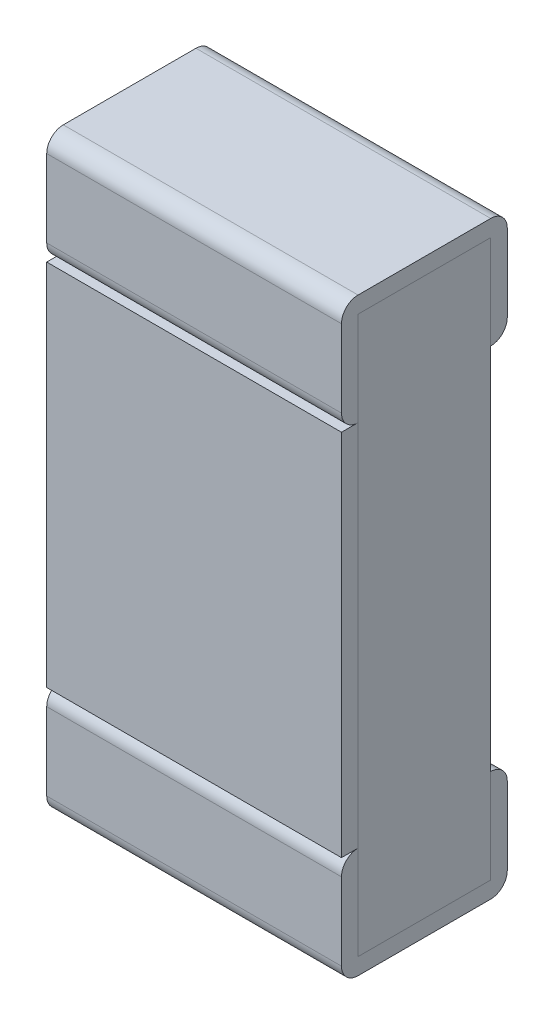
ISO-10303-21;
HEADER;
FILE_DESCRIPTION(('STEP AP214'),'2;1');
FILE_NAME('part.step','',(''),(''),'','','');
FILE_SCHEMA(('AUTOMOTIVE_DESIGN { 1 0 10303 214 1 1 1 1 }'));
ENDSEC;
DATA;
#1=APPLICATION_CONTEXT('core data for automotive mechanical design processes');
#2=APPLICATION_PROTOCOL_DEFINITION('international standard','automotive_design',2000,#1);
#3=PRODUCT_CONTEXT('',#1,'mechanical');
#4=PRODUCT('Part','Part','',(#3));
#5=PRODUCT_RELATED_PRODUCT_CATEGORY('part','',(#4));
#6=PRODUCT_DEFINITION_FORMATION('','',#4);
#7=PRODUCT_DEFINITION_CONTEXT('part definition',#1,'design');
#8=PRODUCT_DEFINITION('design','',#6,#7);
#9=PRODUCT_DEFINITION_SHAPE('','',#8);
#10=(LENGTH_UNIT() NAMED_UNIT(*) SI_UNIT(.MILLI.,.METRE.));
#11=(NAMED_UNIT(*) PLANE_ANGLE_UNIT() SI_UNIT($,.RADIAN.));
#12=(NAMED_UNIT(*) SI_UNIT($,.STERADIAN.) SOLID_ANGLE_UNIT());
#13=UNCERTAINTY_MEASURE_WITH_UNIT(LENGTH_MEASURE(1.E-05),#10,'distance_accuracy_value','');
#14=(GEOMETRIC_REPRESENTATION_CONTEXT(3) GLOBAL_UNCERTAINTY_ASSIGNED_CONTEXT((#13)) GLOBAL_UNIT_ASSIGNED_CONTEXT((#10,
#11,#12)) REPRESENTATION_CONTEXT('',''));
#15=CARTESIAN_POINT('',(0.,0.,0.));
#16=DIRECTION('',(0.,0.,1.));
#17=DIRECTION('',(1.,0.,0.));
#18=AXIS2_PLACEMENT_3D('',#15,#16,#17);
#19=CARTESIAN_POINT('',(184.063244279938,109.49429329235,112.661582908599));
#20=DIRECTION('',(0.,0.,1.));
#21=DIRECTION('',(1.,0.,0.));
#22=AXIS2_PLACEMENT_3D('',#19,#20,#21);
#23=PLANE('',#22);
#24=DIRECTION('',(1.,0.,0.));
#25=VECTOR('',#24,1.);
#26=CARTESIAN_POINT('',(184.063244279938,109.49429329235,112.661582908599));
#27=LINE('',#26,#25);
#28=CARTESIAN_POINT('',(184.063244279938,109.49429329235,112.661582908599));
#29=VERTEX_POINT('',#28);
#30=CARTESIAN_POINT('',(184.863244279938,109.49429329235,112.661582908599));
#31=VERTEX_POINT('',#30);
#32=EDGE_CURVE('E64',#29,#31,#27,.T.);
#33=ORIENTED_EDGE('',*,*,#32,.F.);
#34=DIRECTION('',(0.,-1.,0.));
#35=VECTOR('',#34,1.);
#36=CARTESIAN_POINT('',(184.063244279938,109.49429329235,112.661582908599));
#37=LINE('',#36,#35);
#38=CARTESIAN_POINT('',(184.063244279938,108.49429329235,112.661582908599));
#39=VERTEX_POINT('',#38);
#40=EDGE_CURVE('E11',#29,#39,#37,.T.);
#41=ORIENTED_EDGE('',*,*,#40,.T.);
#42=DIRECTION('',(1.,0.,0.));
#43=VECTOR('',#42,1.);
#44=CARTESIAN_POINT('',(184.063244279938,108.49429329235,112.661582908599));
#45=LINE('',#44,#43);
#46=CARTESIAN_POINT('',(184.863244279938,108.49429329235,112.661582908599));
#47=VERTEX_POINT('',#46);
#48=EDGE_CURVE('E54',#39,#47,#45,.T.);
#49=ORIENTED_EDGE('',*,*,#48,.T.);
#50=DIRECTION('',(0.,-1.,0.));
#51=VECTOR('',#50,1.);
#52=CARTESIAN_POINT('',(184.863244279938,109.49429329235,112.661582908599));
#53=LINE('',#52,#51);
#54=EDGE_CURVE('E235',#31,#47,#53,.T.);
#55=ORIENTED_EDGE('',*,*,#54,.F.);
#56=EDGE_LOOP('',(#33,#41,#49,#55));
#57=FACE_BOUND('',#56,.T.);
#58=ADVANCED_FACE('F44',(#57),#23,.T.);
#59=CARTESIAN_POINT('',(184.063244279938,108.49429329235,112.616582908599));
#60=DIRECTION('',(0.,-1.,0.));
#61=DIRECTION('',(0.,0.,-1.));
#62=AXIS2_PLACEMENT_3D('',#59,#60,#61);
#63=PLANE('',#62);
#64=DIRECTION('',(0.,0.,1.));
#65=VECTOR('',#64,1.);
#66=CARTESIAN_POINT('',(184.063244279938,108.49429329235,112.616582908599));
#67=LINE('',#66,#65);
#68=CARTESIAN_POINT('',(184.063244279938,108.49429329235,112.616582908599));
#69=VERTEX_POINT('',#68);
#70=EDGE_CURVE('E309',#69,#39,#67,.T.);
#71=ORIENTED_EDGE('',*,*,#70,.F.);
#72=DIRECTION('',(1.,0.,0.));
#73=VECTOR('',#72,1.);
#74=CARTESIAN_POINT('',(184.063244279938,108.49429329235,112.616582908599));
#75=LINE('',#74,#73);
#76=CARTESIAN_POINT('',(184.863244279938,108.49429329235,112.616582908599));
#77=VERTEX_POINT('',#76);
#78=EDGE_CURVE('E352',#69,#77,#75,.T.);
#79=ORIENTED_EDGE('',*,*,#78,.T.);
#80=DIRECTION('',(0.,0.,1.));
#81=VECTOR('',#80,1.);
#82=CARTESIAN_POINT('',(184.863244279938,108.49429329235,112.616582908599));
#83=LINE('',#82,#81);
#84=EDGE_CURVE('E349',#77,#47,#83,.T.);
#85=ORIENTED_EDGE('',*,*,#84,.T.);
#86=ORIENTED_EDGE('',*,*,#48,.F.);
#87=EDGE_LOOP('',(#71,#79,#85,#86));
#88=FACE_BOUND('',#87,.T.);
#89=ADVANCED_FACE('F46',(#88),#63,.T.);
#90=CARTESIAN_POINT('',(184.063244279938,108.44929329235,112.616582908599));
#91=DIRECTION('',(1.,0.,0.));
#92=DIRECTION('',(0.,1.,0.));
#93=AXIS2_PLACEMENT_3D('',#90,#91,#92);
#94=CYLINDRICAL_SURFACE('',#93,0.0450000000000034);
#95=CARTESIAN_POINT('',(184.063244279938,108.44929329235,112.616582908599));
#96=DIRECTION('',(1.,0.,0.));
#97=DIRECTION('',(0.,0.,1.));
#98=AXIS2_PLACEMENT_3D('',#95,#96,#97);
#99=CIRCLE('',#98,0.0450000000000034);
#100=CARTESIAN_POINT('',(184.063244279938,108.44929329235,112.661582908599));
#101=VERTEX_POINT('',#100);
#102=EDGE_CURVE('E295',#69,#101,#99,.T.);
#103=ORIENTED_EDGE('',*,*,#102,.T.);
#104=DIRECTION('',(1.,0.,0.));
#105=VECTOR('',#104,1.);
#106=CARTESIAN_POINT('',(184.063244279938,108.44929329235,112.661582908599));
#107=LINE('',#106,#105);
#108=CARTESIAN_POINT('',(184.863244279938,108.44929329235,112.661582908599));
#109=VERTEX_POINT('',#108);
#110=EDGE_CURVE('E292',#101,#109,#107,.T.);
#111=ORIENTED_EDGE('',*,*,#110,.T.);
#112=CARTESIAN_POINT('',(184.863244279938,108.44929329235,112.616582908599));
#113=DIRECTION('',(1.,0.,0.));
#114=DIRECTION('',(0.,0.,1.));
#115=AXIS2_PLACEMENT_3D('',#112,#113,#114);
#116=CIRCLE('',#115,0.0450000000000034);
#117=EDGE_CURVE('E356',#77,#109,#116,.T.);
#118=ORIENTED_EDGE('',*,*,#117,.F.);
#119=ORIENTED_EDGE('',*,*,#78,.F.);
#120=EDGE_LOOP('',(#103,#111,#118,#119));
#121=FACE_BOUND('',#120,.T.);
#122=ADVANCED_FACE('F550',(#121),#94,.T.);
#123=CARTESIAN_POINT('',(184.063244279938,108.49429329235,112.661582908599));
#124=DIRECTION('',(0.,0.,1.));
#125=DIRECTION('',(1.,0.,0.));
#126=AXIS2_PLACEMENT_3D('',#123,#124,#125);
#127=PLANE('',#126);
#128=DIRECTION('',(0.,-1.,0.));
#129=VECTOR('',#128,1.);
#130=CARTESIAN_POINT('',(184.863244279938,108.49429329235,112.661582908599));
#131=LINE('',#130,#129);
#132=CARTESIAN_POINT('',(184.863244279938,108.23929329235,112.661582908599));
#133=VERTEX_POINT('',#132);
#134=EDGE_CURVE('E331',#109,#133,#131,.T.);
#135=ORIENTED_EDGE('',*,*,#134,.F.);
#136=ORIENTED_EDGE('',*,*,#110,.F.);
#137=DIRECTION('',(0.,-1.,0.));
#138=VECTOR('',#137,1.);
#139=CARTESIAN_POINT('',(184.063244279938,108.49429329235,112.661582908599));
#140=LINE('',#139,#138);
#141=CARTESIAN_POINT('',(184.063244279938,108.23929329235,112.661582908599));
#142=VERTEX_POINT('',#141);
#143=EDGE_CURVE('E296',#101,#142,#140,.T.);
#144=ORIENTED_EDGE('',*,*,#143,.T.);
#145=DIRECTION('',(1.,0.,0.));
#146=VECTOR('',#145,1.);
#147=CARTESIAN_POINT('',(184.063244279938,108.23929329235,112.661582908599));
#148=LINE('',#147,#146);
#149=EDGE_CURVE('E267',#142,#133,#148,.T.);
#150=ORIENTED_EDGE('',*,*,#149,.T.);
#151=EDGE_LOOP('',(#135,#136,#144,#150));
#152=FACE_BOUND('',#151,.T.);
#153=ADVANCED_FACE('F567',(#152),#127,.T.);
#154=CARTESIAN_POINT('',(184.063244279938,108.23929329235,112.616582908599));
#155=DIRECTION('',(1.,0.,0.));
#156=DIRECTION('',(0.,-1.,0.));
#157=AXIS2_PLACEMENT_3D('',#154,#155,#156);
#158=CYLINDRICAL_SURFACE('',#157,0.0450000000000034);
#159=DIRECTION('',(1.,0.,0.));
#160=VECTOR('',#159,1.);
#161=CARTESIAN_POINT('',(184.063244279938,108.19429329235,112.616582908599));
#162=LINE('',#161,#160);
#163=CARTESIAN_POINT('',(184.063244279938,108.19429329235,112.616582908599));
#164=VERTEX_POINT('',#163);
#165=CARTESIAN_POINT('',(184.863244279938,108.19429329235,112.616582908599));
#166=VERTEX_POINT('',#165);
#167=EDGE_CURVE('E263',#164,#166,#162,.T.);
#168=ORIENTED_EDGE('',*,*,#167,.T.);
#169=CARTESIAN_POINT('',(184.863244279938,108.23929329235,112.616582908599));
#170=DIRECTION('',(-1.,0.,0.));
#171=DIRECTION('',(0.,0.,1.));
#172=AXIS2_PLACEMENT_3D('',#169,#170,#171);
#173=CIRCLE('',#172,0.0450000000000034);
#174=EDGE_CURVE('E268',#166,#133,#173,.T.);
#175=ORIENTED_EDGE('',*,*,#174,.T.);
#176=ORIENTED_EDGE('',*,*,#149,.F.);
#177=CARTESIAN_POINT('',(184.063244279938,108.23929329235,112.616582908599));
#178=DIRECTION('',(-1.,0.,0.));
#179=DIRECTION('',(0.,0.,1.));
#180=AXIS2_PLACEMENT_3D('',#177,#178,#179);
#181=CIRCLE('',#180,0.0450000000000034);
#182=EDGE_CURVE('E286',#164,#142,#181,.T.);
#183=ORIENTED_EDGE('',*,*,#182,.F.);
#184=EDGE_LOOP('',(#168,#175,#176,#183));
#185=FACE_BOUND('',#184,.T.);
#186=ADVANCED_FACE('F570',(#185),#158,.T.);
#187=CARTESIAN_POINT('',(184.063244279938,108.19429329235,112.211582908599));
#188=DIRECTION('',(0.,-1.,0.));
#189=DIRECTION('',(0.,0.,-1.));
#190=AXIS2_PLACEMENT_3D('',#187,#188,#189);
#191=PLANE('',#190);
#192=DIRECTION('',(0.,0.,1.));
#193=VECTOR('',#192,1.);
#194=CARTESIAN_POINT('',(184.063244279938,108.19429329235,112.211582908599));
#195=LINE('',#194,#193);
#196=CARTESIAN_POINT('',(184.063244279938,108.19429329235,112.256582908599));
#197=VERTEX_POINT('',#196);
#198=EDGE_CURVE('E281',#197,#164,#195,.T.);
#199=ORIENTED_EDGE('',*,*,#198,.F.);
#200=DIRECTION('',(1.,0.,0.));
#201=VECTOR('',#200,1.);
#202=CARTESIAN_POINT('',(184.063244279938,108.19429329235,112.256582908599));
#203=LINE('',#202,#201);
#204=CARTESIAN_POINT('',(184.863244279938,108.19429329235,112.256582908599));
#205=VERTEX_POINT('',#204);
#206=EDGE_CURVE('E371',#197,#205,#203,.T.);
#207=ORIENTED_EDGE('',*,*,#206,.T.);
#208=DIRECTION('',(0.,0.,1.));
#209=VECTOR('',#208,1.);
#210=CARTESIAN_POINT('',(184.863244279938,108.19429329235,112.211582908599));
#211=LINE('',#210,#209);
#212=EDGE_CURVE('E273',#205,#166,#211,.T.);
#213=ORIENTED_EDGE('',*,*,#212,.T.);
#214=ORIENTED_EDGE('',*,*,#167,.F.);
#215=EDGE_LOOP('',(#199,#207,#213,#214));
#216=FACE_BOUND('',#215,.T.);
#217=ADVANCED_FACE('F572',(#216),#191,.T.);
#218=CARTESIAN_POINT('',(184.063244279938,108.23929329235,112.256582908599));
#219=DIRECTION('',(1.,0.,0.));
#220=DIRECTION('',(0.,-1.,0.));
#221=AXIS2_PLACEMENT_3D('',#218,#219,#220);
#222=CYLINDRICAL_SURFACE('',#221,0.0450000000000034);
#223=CARTESIAN_POINT('',(184.063244279938,108.23929329235,112.256582908599));
#224=DIRECTION('',(1.,0.,0.));
#225=DIRECTION('',(0.,0.,1.));
#226=AXIS2_PLACEMENT_3D('',#223,#224,#225);
#227=CIRCLE('',#226,0.0450000000000034);
#228=CARTESIAN_POINT('',(184.063244279938,108.23929329235,112.211582908599));
#229=VERTEX_POINT('',#228);
#230=EDGE_CURVE('E269',#197,#229,#227,.T.);
#231=ORIENTED_EDGE('',*,*,#230,.T.);
#232=DIRECTION('',(1.,0.,0.));
#233=VECTOR('',#232,1.);
#234=CARTESIAN_POINT('',(184.063244279938,108.23929329235,112.211582908599));
#235=LINE('',#234,#233);
#236=CARTESIAN_POINT('',(184.863244279938,108.23929329235,112.211582908599));
#237=VERTEX_POINT('',#236);
#238=EDGE_CURVE('E274',#229,#237,#235,.T.);
#239=ORIENTED_EDGE('',*,*,#238,.T.);
#240=CARTESIAN_POINT('',(184.863244279938,108.23929329235,112.256582908599));
#241=DIRECTION('',(1.,0.,0.));
#242=DIRECTION('',(0.,0.,1.));
#243=AXIS2_PLACEMENT_3D('',#240,#241,#242);
#244=CIRCLE('',#243,0.0450000000000034);
#245=EDGE_CURVE('E233',#205,#237,#244,.T.);
#246=ORIENTED_EDGE('',*,*,#245,.F.);
#247=ORIENTED_EDGE('',*,*,#206,.F.);
#248=EDGE_LOOP('',(#231,#239,#246,#247));
#249=FACE_BOUND('',#248,.T.);
#250=ADVANCED_FACE('F611',(#249),#222,.T.);
#251=CARTESIAN_POINT('',(184.063244279938,108.49429329235,112.211582908599));
#252=DIRECTION('',(0.,0.,1.));
#253=DIRECTION('',(1.,0.,0.));
#254=AXIS2_PLACEMENT_3D('',#251,#252,#253);
#255=PLANE('',#254);
#256=ORIENTED_EDGE('',*,*,#238,.F.);
#257=DIRECTION('',(0.,-1.,0.));
#258=VECTOR('',#257,1.);
#259=CARTESIAN_POINT('',(184.063244279938,108.49429329235,112.211582908599));
#260=LINE('',#259,#258);
#261=CARTESIAN_POINT('',(184.063244279938,108.44929329235,112.211582908599));
#262=VERTEX_POINT('',#261);
#263=EDGE_CURVE('E258',#262,#229,#260,.T.);
#264=ORIENTED_EDGE('',*,*,#263,.F.);
#265=DIRECTION('',(1.,0.,0.));
#266=VECTOR('',#265,1.);
#267=CARTESIAN_POINT('',(184.063244279938,108.44929329235,112.211582908599));
#268=LINE('',#267,#266);
#269=CARTESIAN_POINT('',(184.863244279938,108.44929329235,112.211582908599));
#270=VERTEX_POINT('',#269);
#271=EDGE_CURVE('E302',#262,#270,#268,.T.);
#272=ORIENTED_EDGE('',*,*,#271,.T.);
#273=DIRECTION('',(0.,-1.,0.));
#274=VECTOR('',#273,1.);
#275=CARTESIAN_POINT('',(184.863244279938,108.49429329235,112.211582908599));
#276=LINE('',#275,#274);
#277=EDGE_CURVE('E298',#270,#237,#276,.T.);
#278=ORIENTED_EDGE('',*,*,#277,.T.);
#279=EDGE_LOOP('',(#256,#264,#272,#278));
#280=FACE_BOUND('',#279,.T.);
#281=ADVANCED_FACE('F618',(#280),#255,.F.);
#282=CARTESIAN_POINT('',(184.063244279938,108.44929329235,112.256582908599));
#283=DIRECTION('',(1.,0.,0.));
#284=DIRECTION('',(0.,1.,0.));
#285=AXIS2_PLACEMENT_3D('',#282,#283,#284);
#286=CYLINDRICAL_SURFACE('',#285,0.0450000000000034);
#287=DIRECTION('',(1.,0.,0.));
#288=VECTOR('',#287,1.);
#289=CARTESIAN_POINT('',(184.063244279938,108.49429329235,112.256582908599));
#290=LINE('',#289,#288);
#291=CARTESIAN_POINT('',(184.063244279938,108.49429329235,112.256582908599));
#292=VERTEX_POINT('',#291);
#293=CARTESIAN_POINT('',(184.863244279938,108.49429329235,112.256582908599));
#294=VERTEX_POINT('',#293);
#295=EDGE_CURVE('E252',#292,#294,#290,.T.);
#296=ORIENTED_EDGE('',*,*,#295,.T.);
#297=CARTESIAN_POINT('',(184.863244279938,108.44929329235,112.256582908599));
#298=DIRECTION('',(-1.,0.,0.));
#299=DIRECTION('',(0.,0.,1.));
#300=AXIS2_PLACEMENT_3D('',#297,#298,#299);
#301=CIRCLE('',#300,0.0450000000000034);
#302=EDGE_CURVE('E245',#294,#270,#301,.T.);
#303=ORIENTED_EDGE('',*,*,#302,.T.);
#304=ORIENTED_EDGE('',*,*,#271,.F.);
#305=CARTESIAN_POINT('',(184.063244279938,108.44929329235,112.256582908599));
#306=DIRECTION('',(-1.,0.,0.));
#307=DIRECTION('',(0.,0.,1.));
#308=AXIS2_PLACEMENT_3D('',#305,#306,#307);
#309=CIRCLE('',#308,0.0450000000000034);
#310=EDGE_CURVE('E261',#292,#262,#309,.T.);
#311=ORIENTED_EDGE('',*,*,#310,.F.);
#312=EDGE_LOOP('',(#296,#303,#304,#311));
#313=FACE_BOUND('',#312,.T.);
#314=ADVANCED_FACE('F541',(#313),#286,.T.);
#315=CARTESIAN_POINT('',(184.863244279938,109.49429329235,112.616582908599));
#316=DIRECTION('',(1.,0.,0.));
#317=DIRECTION('',(0.,0.,1.));
#318=AXIS2_PLACEMENT_3D('',#315,#316,#317);
#319=PLANE('',#318);
#320=DIRECTION('',(0.,-1.,0.));
#321=VECTOR('',#320,1.);
#322=CARTESIAN_POINT('',(184.863244279938,109.49429329235,112.616582908599));
#323=LINE('',#322,#321);
#324=CARTESIAN_POINT('',(184.863244279938,109.49429329235,112.616582908599));
#325=VERTEX_POINT('',#324);
#326=EDGE_CURVE('E242',#325,#77,#323,.T.);
#327=ORIENTED_EDGE('',*,*,#326,.F.);
#328=DIRECTION('',(0.,0.,1.));
#329=VECTOR('',#328,1.);
#330=CARTESIAN_POINT('',(184.863244279938,109.49429329235,112.616582908599));
#331=LINE('',#330,#329);
#332=EDGE_CURVE('E228',#325,#31,#331,.T.);
#333=ORIENTED_EDGE('',*,*,#332,.T.);
#334=ORIENTED_EDGE('',*,*,#54,.T.);
#335=ORIENTED_EDGE('',*,*,#84,.F.);
#336=EDGE_LOOP('',(#327,#333,#334,#335));
#337=FACE_BOUND('',#336,.T.);
#338=ADVANCED_FACE('F241',(#337),#319,.T.);
#339=CARTESIAN_POINT('',(184.863244279938,108.49429329235,112.211582908599));
#340=DIRECTION('',(1.,0.,0.));
#341=DIRECTION('',(0.,0.,1.));
#342=AXIS2_PLACEMENT_3D('',#339,#340,#341);
#343=PLANE('',#342);
#344=ORIENTED_EDGE('',*,*,#277,.F.);
#345=ORIENTED_EDGE('',*,*,#302,.F.);
#346=DIRECTION('',(0.,-1.,0.));
#347=VECTOR('',#346,1.);
#348=CARTESIAN_POINT('',(184.863244279938,109.74929329235,112.256582908599));
#349=LINE('',#348,#347);
#350=CARTESIAN_POINT('',(184.863244279938,108.23929329235,112.256582908599));
#351=VERTEX_POINT('',#350);
#352=EDGE_CURVE('E48',#294,#351,#349,.T.);
#353=ORIENTED_EDGE('',*,*,#352,.T.);
#354=DIRECTION('',(0.,0.,1.));
#355=VECTOR('',#354,1.);
#356=CARTESIAN_POINT('',(184.863244279938,108.23929329235,112.256582908599));
#357=LINE('',#356,#355);
#358=CARTESIAN_POINT('',(184.863244279938,108.23929329235,112.616582908599));
#359=VERTEX_POINT('',#358);
#360=EDGE_CURVE('E357',#351,#359,#357,.T.);
#361=ORIENTED_EDGE('',*,*,#360,.T.);
#362=DIRECTION('',(0.,-1.,0.));
#363=VECTOR('',#362,1.);
#364=CARTESIAN_POINT('',(184.863244279938,109.74929329235,112.616582908599));
#365=LINE('',#364,#363);
#366=EDGE_CURVE('E374',#77,#359,#365,.T.);
#367=ORIENTED_EDGE('',*,*,#366,.F.);
#368=ORIENTED_EDGE('',*,*,#117,.T.);
#369=ORIENTED_EDGE('',*,*,#134,.T.);
#370=ORIENTED_EDGE('',*,*,#174,.F.);
#371=ORIENTED_EDGE('',*,*,#212,.F.);
#372=ORIENTED_EDGE('',*,*,#245,.T.);
#373=EDGE_LOOP('',(#344,#345,#353,#361,#367,#368,#369,#370,#371,#372));
#374=FACE_BOUND('',#373,.T.);
#375=ADVANCED_FACE('F537',(#374),#343,.T.);
#376=CARTESIAN_POINT('',(184.063244279938,109.49429329235,112.616582908599));
#377=DIRECTION('',(0.,-1.,0.));
#378=DIRECTION('',(0.,0.,-1.));
#379=AXIS2_PLACEMENT_3D('',#376,#377,#378);
#380=PLANE('',#379);
#381=ORIENTED_EDGE('',*,*,#32,.T.);
#382=ORIENTED_EDGE('',*,*,#332,.F.);
#383=DIRECTION('',(1.,0.,0.));
#384=VECTOR('',#383,1.);
#385=CARTESIAN_POINT('',(184.063244279938,109.49429329235,112.616582908599));
#386=LINE('',#385,#384);
#387=CARTESIAN_POINT('',(184.063244279938,109.49429329235,112.616582908599));
#388=VERTEX_POINT('',#387);
#389=EDGE_CURVE('E372',#388,#325,#386,.T.);
#390=ORIENTED_EDGE('',*,*,#389,.F.);
#391=DIRECTION('',(0.,0.,1.));
#392=VECTOR('',#391,1.);
#393=CARTESIAN_POINT('',(184.063244279938,109.49429329235,112.616582908599));
#394=LINE('',#393,#392);
#395=EDGE_CURVE('E231',#388,#29,#394,.T.);
#396=ORIENTED_EDGE('',*,*,#395,.T.);
#397=EDGE_LOOP('',(#381,#382,#390,#396));
#398=FACE_BOUND('',#397,.T.);
#399=ADVANCED_FACE('F225',(#398),#380,.F.);
#400=CARTESIAN_POINT('',(184.063244279938,109.49429329235,112.616582908599));
#401=DIRECTION('',(1.,0.,0.));
#402=DIRECTION('',(0.,0.,1.));
#403=AXIS2_PLACEMENT_3D('',#400,#401,#402);
#404=PLANE('',#403);
#405=ORIENTED_EDGE('',*,*,#70,.T.);
#406=ORIENTED_EDGE('',*,*,#40,.F.);
#407=ORIENTED_EDGE('',*,*,#395,.F.);
#408=DIRECTION('',(0.,-1.,0.));
#409=VECTOR('',#408,1.);
#410=CARTESIAN_POINT('',(184.063244279938,109.49429329235,112.616582908599));
#411=LINE('',#410,#409);
#412=EDGE_CURVE('E285',#388,#69,#411,.T.);
#413=ORIENTED_EDGE('',*,*,#412,.T.);
#414=EDGE_LOOP('',(#405,#406,#407,#413));
#415=FACE_BOUND('',#414,.T.);
#416=ADVANCED_FACE('F500',(#415),#404,.F.);
#417=CARTESIAN_POINT('',(184.063244279938,108.49429329235,112.211582908599));
#418=DIRECTION('',(1.,0.,0.));
#419=DIRECTION('',(0.,0.,1.));
#420=AXIS2_PLACEMENT_3D('',#417,#418,#419);
#421=PLANE('',#420);
#422=ORIENTED_EDGE('',*,*,#230,.F.);
#423=ORIENTED_EDGE('',*,*,#198,.T.);
#424=ORIENTED_EDGE('',*,*,#182,.T.);
#425=ORIENTED_EDGE('',*,*,#143,.F.);
#426=ORIENTED_EDGE('',*,*,#102,.F.);
#427=DIRECTION('',(0.,-1.,0.));
#428=VECTOR('',#427,1.);
#429=CARTESIAN_POINT('',(184.063244279938,109.74929329235,112.616582908599));
#430=LINE('',#429,#428);
#431=CARTESIAN_POINT('',(184.063244279938,108.23929329235,112.616582908599));
#432=VERTEX_POINT('',#431);
#433=EDGE_CURVE('E306',#69,#432,#430,.T.);
#434=ORIENTED_EDGE('',*,*,#433,.T.);
#435=DIRECTION('',(0.,0.,1.));
#436=VECTOR('',#435,1.);
#437=CARTESIAN_POINT('',(184.063244279938,108.23929329235,112.256582908599));
#438=LINE('',#437,#436);
#439=CARTESIAN_POINT('',(184.063244279938,108.23929329235,112.256582908599));
#440=VERTEX_POINT('',#439);
#441=EDGE_CURVE('E360',#440,#432,#438,.T.);
#442=ORIENTED_EDGE('',*,*,#441,.F.);
#443=DIRECTION('',(0.,-1.,0.));
#444=VECTOR('',#443,1.);
#445=CARTESIAN_POINT('',(184.063244279938,109.74929329235,112.256582908599));
#446=LINE('',#445,#444);
#447=EDGE_CURVE('E324',#292,#440,#446,.T.);
#448=ORIENTED_EDGE('',*,*,#447,.F.);
#449=ORIENTED_EDGE('',*,*,#310,.T.);
#450=ORIENTED_EDGE('',*,*,#263,.T.);
#451=EDGE_LOOP('',(#422,#423,#424,#425,#426,#434,#442,#448,#449,#450));
#452=FACE_BOUND('',#451,.T.);
#453=ADVANCED_FACE('F544',(#452),#421,.F.);
#454=CARTESIAN_POINT('',(184.063244279938,109.74929329235,112.256582908599));
#455=DIRECTION('',(0.,0.,1.));
#456=DIRECTION('',(1.,0.,0.));
#457=AXIS2_PLACEMENT_3D('',#454,#455,#456);
#458=PLANE('',#457);
#459=DIRECTION('',(0.,-1.,0.));
#460=VECTOR('',#459,1.);
#461=CARTESIAN_POINT('',(184.863244279938,109.74929329235,112.256582908599));
#462=LINE('',#461,#460);
#463=CARTESIAN_POINT('',(184.863244279938,109.49429329235,112.256582908599));
#464=VERTEX_POINT('',#463);
#465=EDGE_CURVE('E262',#464,#294,#462,.T.);
#466=ORIENTED_EDGE('',*,*,#465,.T.);
#467=ORIENTED_EDGE('',*,*,#295,.F.);
#468=DIRECTION('',(0.,-1.,0.));
#469=VECTOR('',#468,1.);
#470=CARTESIAN_POINT('',(184.063244279938,109.74929329235,112.256582908599));
#471=LINE('',#470,#469);
#472=CARTESIAN_POINT('',(184.063244279938,109.49429329235,112.256582908599));
#473=VERTEX_POINT('',#472);
#474=EDGE_CURVE('E291',#473,#292,#471,.T.);
#475=ORIENTED_EDGE('',*,*,#474,.F.);
#476=DIRECTION('',(1.,0.,0.));
#477=VECTOR('',#476,1.);
#478=CARTESIAN_POINT('',(184.063244279938,109.49429329235,112.256582908599));
#479=LINE('',#478,#477);
#480=EDGE_CURVE('E316',#473,#464,#479,.T.);
#481=ORIENTED_EDGE('',*,*,#480,.T.);
#482=EDGE_LOOP('',(#466,#467,#475,#481));
#483=FACE_BOUND('',#482,.T.);
#484=ADVANCED_FACE('F510',(#483),#458,.F.);
#485=CARTESIAN_POINT('',(184.863244279938,109.74929329235,112.256582908599));
#486=DIRECTION('',(1.,0.,0.));
#487=DIRECTION('',(0.,0.,1.));
#488=AXIS2_PLACEMENT_3D('',#485,#486,#487);
#489=PLANE('',#488);
#490=DIRECTION('',(0.,-1.,0.));
#491=VECTOR('',#490,1.);
#492=CARTESIAN_POINT('',(184.863244279938,109.74929329235,112.256582908599));
#493=LINE('',#492,#491);
#494=CARTESIAN_POINT('',(184.863244279938,109.74929329235,112.256582908599));
#495=VERTEX_POINT('',#494);
#496=EDGE_CURVE('E315',#495,#464,#493,.T.);
#497=ORIENTED_EDGE('',*,*,#496,.F.);
#498=DIRECTION('',(0.,0.,1.));
#499=VECTOR('',#498,1.);
#500=CARTESIAN_POINT('',(184.863244279938,109.74929329235,112.256582908599));
#501=LINE('',#500,#499);
#502=CARTESIAN_POINT('',(184.863244279938,109.74929329235,112.616582908599));
#503=VERTEX_POINT('',#502);
#504=EDGE_CURVE('E320',#495,#503,#501,.T.);
#505=ORIENTED_EDGE('',*,*,#504,.T.);
#506=DIRECTION('',(0.,-1.,0.));
#507=VECTOR('',#506,1.);
#508=CARTESIAN_POINT('',(184.863244279938,109.74929329235,112.616582908599));
#509=LINE('',#508,#507);
#510=EDGE_CURVE('E367',#503,#325,#509,.T.);
#511=ORIENTED_EDGE('',*,*,#510,.T.);
#512=ORIENTED_EDGE('',*,*,#326,.T.);
#513=ORIENTED_EDGE('',*,*,#366,.T.);
#514=ORIENTED_EDGE('',*,*,#360,.F.);
#515=ORIENTED_EDGE('',*,*,#352,.F.);
#516=ORIENTED_EDGE('',*,*,#465,.F.);
#517=EDGE_LOOP('',(#497,#505,#511,#512,#513,#514,#515,#516));
#518=FACE_BOUND('',#517,.T.);
#519=ADVANCED_FACE('F483',(#518),#489,.T.);
#520=CARTESIAN_POINT('',(184.063244279938,109.53929329235,112.616582908599));
#521=DIRECTION('',(1.,0.,0.));
#522=DIRECTION('',(0.,-1.,0.));
#523=AXIS2_PLACEMENT_3D('',#520,#521,#522);
#524=CYLINDRICAL_SURFACE('',#523,0.0450000000000034);
#525=ORIENTED_EDGE('',*,*,#389,.T.);
#526=CARTESIAN_POINT('',(184.863244279938,109.53929329235,112.616582908599));
#527=DIRECTION('',(-1.,0.,0.));
#528=DIRECTION('',(0.,0.,1.));
#529=AXIS2_PLACEMENT_3D('',#526,#527,#528);
#530=CIRCLE('',#529,0.0450000000000034);
#531=CARTESIAN_POINT('',(184.863244279938,109.53929329235,112.661582908599));
#532=VERTEX_POINT('',#531);
#533=EDGE_CURVE('E375',#325,#532,#530,.T.);
#534=ORIENTED_EDGE('',*,*,#533,.T.);
#535=DIRECTION('',(1.,0.,0.));
#536=VECTOR('',#535,1.);
#537=CARTESIAN_POINT('',(184.063244279938,109.53929329235,112.661582908599));
#538=LINE('',#537,#536);
#539=CARTESIAN_POINT('',(184.063244279938,109.53929329235,112.661582908599));
#540=VERTEX_POINT('',#539);
#541=EDGE_CURVE('E287',#540,#532,#538,.T.);
#542=ORIENTED_EDGE('',*,*,#541,.F.);
#543=CARTESIAN_POINT('',(184.063244279938,109.53929329235,112.616582908599));
#544=DIRECTION('',(-1.,0.,0.));
#545=DIRECTION('',(0.,0.,1.));
#546=AXIS2_PLACEMENT_3D('',#543,#544,#545);
#547=CIRCLE('',#546,0.0450000000000034);
#548=EDGE_CURVE('E348',#388,#540,#547,.T.);
#549=ORIENTED_EDGE('',*,*,#548,.F.);
#550=EDGE_LOOP('',(#525,#534,#542,#549));
#551=FACE_BOUND('',#550,.T.);
#552=ADVANCED_FACE('F491',(#551),#524,.T.);
#553=CARTESIAN_POINT('',(184.063244279938,109.79429329235,112.661582908599));
#554=DIRECTION('',(0.,0.,1.));
#555=DIRECTION('',(1.,0.,0.));
#556=AXIS2_PLACEMENT_3D('',#553,#554,#555);
#557=PLANE('',#556);
#558=DIRECTION('',(0.,-1.,0.));
#559=VECTOR('',#558,1.);
#560=CARTESIAN_POINT('',(184.863244279938,109.79429329235,112.661582908599));
#561=LINE('',#560,#559);
#562=CARTESIAN_POINT('',(184.863244279938,109.74929329235,112.661582908599));
#563=VERTEX_POINT('',#562);
#564=EDGE_CURVE('E310',#563,#532,#561,.T.);
#565=ORIENTED_EDGE('',*,*,#564,.F.);
#566=DIRECTION('',(1.,0.,0.));
#567=VECTOR('',#566,1.);
#568=CARTESIAN_POINT('',(184.063244279938,109.74929329235,112.661582908599));
#569=LINE('',#568,#567);
#570=CARTESIAN_POINT('',(184.063244279938,109.74929329235,112.661582908599));
#571=VERTEX_POINT('',#570);
#572=EDGE_CURVE('E386',#571,#563,#569,.T.);
#573=ORIENTED_EDGE('',*,*,#572,.F.);
#574=DIRECTION('',(0.,-1.,0.));
#575=VECTOR('',#574,1.);
#576=CARTESIAN_POINT('',(184.063244279938,109.79429329235,112.661582908599));
#577=LINE('',#576,#575);
#578=EDGE_CURVE('E290',#571,#540,#577,.T.);
#579=ORIENTED_EDGE('',*,*,#578,.T.);
#580=ORIENTED_EDGE('',*,*,#541,.T.);
#581=EDGE_LOOP('',(#565,#573,#579,#580));
#582=FACE_BOUND('',#581,.T.);
#583=ADVANCED_FACE('F490',(#582),#557,.T.);
#584=CARTESIAN_POINT('',(184.063244279938,109.74929329235,112.256582908599));
#585=DIRECTION('',(1.,0.,0.));
#586=DIRECTION('',(0.,0.,1.));
#587=AXIS2_PLACEMENT_3D('',#584,#585,#586);
#588=PLANE('',#587);
#589=ORIENTED_EDGE('',*,*,#474,.T.);
#590=ORIENTED_EDGE('',*,*,#447,.T.);
#591=ORIENTED_EDGE('',*,*,#441,.T.);
#592=ORIENTED_EDGE('',*,*,#433,.F.);
#593=ORIENTED_EDGE('',*,*,#412,.F.);
#594=DIRECTION('',(0.,-1.,0.));
#595=VECTOR('',#594,1.);
#596=CARTESIAN_POINT('',(184.063244279938,109.74929329235,112.616582908599));
#597=LINE('',#596,#595);
#598=CARTESIAN_POINT('',(184.063244279938,109.74929329235,112.616582908599));
#599=VERTEX_POINT('',#598);
#600=EDGE_CURVE('E280',#599,#388,#597,.T.);
#601=ORIENTED_EDGE('',*,*,#600,.F.);
#602=DIRECTION('',(0.,0.,1.));
#603=VECTOR('',#602,1.);
#604=CARTESIAN_POINT('',(184.063244279938,109.74929329235,112.256582908599));
#605=LINE('',#604,#603);
#606=CARTESIAN_POINT('',(184.063244279938,109.74929329235,112.256582908599));
#607=VERTEX_POINT('',#606);
#608=EDGE_CURVE('E275',#607,#599,#605,.T.);
#609=ORIENTED_EDGE('',*,*,#608,.F.);
#610=DIRECTION('',(0.,-1.,0.));
#611=VECTOR('',#610,1.);
#612=CARTESIAN_POINT('',(184.063244279938,109.74929329235,112.256582908599));
#613=LINE('',#612,#611);
#614=EDGE_CURVE('E364',#607,#473,#613,.T.);
#615=ORIENTED_EDGE('',*,*,#614,.T.);
#616=EDGE_LOOP('',(#589,#590,#591,#592,#593,#601,#609,#615));
#617=FACE_BOUND('',#616,.T.);
#618=ADVANCED_FACE('F497',(#617),#588,.F.);
#619=CARTESIAN_POINT('',(184.063244279938,109.53929329235,112.256582908599));
#620=DIRECTION('',(1.,0.,0.));
#621=DIRECTION('',(0.,-1.,0.));
#622=AXIS2_PLACEMENT_3D('',#619,#620,#621);
#623=CYLINDRICAL_SURFACE('',#622,0.0450000000000034);
#624=CARTESIAN_POINT('',(184.063244279938,109.53929329235,112.256582908599));
#625=DIRECTION('',(1.,0.,0.));
#626=DIRECTION('',(0.,0.,1.));
#627=AXIS2_PLACEMENT_3D('',#624,#625,#626);
#628=CIRCLE('',#627,0.0450000000000034);
#629=CARTESIAN_POINT('',(184.063244279938,109.53929329235,112.211582908599));
#630=VERTEX_POINT('',#629);
#631=EDGE_CURVE('E399',#473,#630,#628,.T.);
#632=ORIENTED_EDGE('',*,*,#631,.T.);
#633=DIRECTION('',(1.,0.,0.));
#634=VECTOR('',#633,1.);
#635=CARTESIAN_POINT('',(184.063244279938,109.53929329235,112.211582908599));
#636=LINE('',#635,#634);
#637=CARTESIAN_POINT('',(184.863244279938,109.53929329235,112.211582908599));
#638=VERTEX_POINT('',#637);
#639=EDGE_CURVE('E403',#630,#638,#636,.T.);
#640=ORIENTED_EDGE('',*,*,#639,.T.);
#641=CARTESIAN_POINT('',(184.863244279938,109.53929329235,112.256582908599));
#642=DIRECTION('',(1.,0.,0.));
#643=DIRECTION('',(0.,0.,1.));
#644=AXIS2_PLACEMENT_3D('',#641,#642,#643);
#645=CIRCLE('',#644,0.0450000000000034);
#646=EDGE_CURVE('E328',#464,#638,#645,.T.);
#647=ORIENTED_EDGE('',*,*,#646,.F.);
#648=ORIENTED_EDGE('',*,*,#480,.F.);
#649=EDGE_LOOP('',(#632,#640,#647,#648));
#650=FACE_BOUND('',#649,.T.);
#651=ADVANCED_FACE('F514',(#650),#623,.T.);
#652=CARTESIAN_POINT('',(184.063244279938,109.79429329235,112.211582908599));
#653=DIRECTION('',(0.,0.,1.));
#654=DIRECTION('',(1.,0.,0.));
#655=AXIS2_PLACEMENT_3D('',#652,#653,#654);
#656=PLANE('',#655);
#657=ORIENTED_EDGE('',*,*,#639,.F.);
#658=DIRECTION('',(0.,-1.,0.));
#659=VECTOR('',#658,1.);
#660=CARTESIAN_POINT('',(184.063244279938,109.79429329235,112.211582908599));
#661=LINE('',#660,#659);
#662=CARTESIAN_POINT('',(184.063244279938,109.74929329235,112.211582908599));
#663=VERTEX_POINT('',#662);
#664=EDGE_CURVE('E336',#663,#630,#661,.T.);
#665=ORIENTED_EDGE('',*,*,#664,.F.);
#666=DIRECTION('',(1.,0.,0.));
#667=VECTOR('',#666,1.);
#668=CARTESIAN_POINT('',(184.063244279938,109.74929329235,112.211582908599));
#669=LINE('',#668,#667);
#670=CARTESIAN_POINT('',(184.863244279938,109.74929329235,112.211582908599));
#671=VERTEX_POINT('',#670);
#672=EDGE_CURVE('E342',#663,#671,#669,.T.);
#673=ORIENTED_EDGE('',*,*,#672,.T.);
#674=DIRECTION('',(0.,-1.,0.));
#675=VECTOR('',#674,1.);
#676=CARTESIAN_POINT('',(184.863244279938,109.79429329235,112.211582908599));
#677=LINE('',#676,#675);
#678=EDGE_CURVE('E338',#671,#638,#677,.T.);
#679=ORIENTED_EDGE('',*,*,#678,.T.);
#680=EDGE_LOOP('',(#657,#665,#673,#679));
#681=FACE_BOUND('',#680,.T.);
#682=ADVANCED_FACE('F520',(#681),#656,.F.);
#683=CARTESIAN_POINT('',(184.863244279938,109.79429329235,112.211582908599));
#684=DIRECTION('',(1.,0.,0.));
#685=DIRECTION('',(0.,0.,1.));
#686=AXIS2_PLACEMENT_3D('',#683,#684,#685);
#687=PLANE('',#686);
#688=ORIENTED_EDGE('',*,*,#678,.F.);
#689=CARTESIAN_POINT('',(184.863244279938,109.74929329235,112.256582908599));
#690=DIRECTION('',(-1.,0.,0.));
#691=DIRECTION('',(0.,0.,1.));
#692=AXIS2_PLACEMENT_3D('',#689,#690,#691);
#693=CIRCLE('',#692,0.0450000000000034);
#694=CARTESIAN_POINT('',(184.863244279938,109.79429329235,112.256582908599));
#695=VERTEX_POINT('',#694);
#696=EDGE_CURVE('E279',#695,#671,#693,.T.);
#697=ORIENTED_EDGE('',*,*,#696,.F.);
#698=DIRECTION('',(0.,0.,1.));
#699=VECTOR('',#698,1.);
#700=CARTESIAN_POINT('',(184.863244279938,109.79429329235,112.211582908599));
#701=LINE('',#700,#699);
#702=CARTESIAN_POINT('',(184.863244279938,109.79429329235,112.616582908599));
#703=VERTEX_POINT('',#702);
#704=EDGE_CURVE('E343',#695,#703,#701,.T.);
#705=ORIENTED_EDGE('',*,*,#704,.T.);
#706=CARTESIAN_POINT('',(184.863244279938,109.74929329235,112.616582908599));
#707=DIRECTION('',(1.,0.,0.));
#708=DIRECTION('',(0.,0.,1.));
#709=AXIS2_PLACEMENT_3D('',#706,#707,#708);
#710=CIRCLE('',#709,0.0450000000000034);
#711=EDGE_CURVE('E314',#703,#563,#710,.T.);
#712=ORIENTED_EDGE('',*,*,#711,.T.);
#713=ORIENTED_EDGE('',*,*,#564,.T.);
#714=ORIENTED_EDGE('',*,*,#533,.F.);
#715=ORIENTED_EDGE('',*,*,#510,.F.);
#716=ORIENTED_EDGE('',*,*,#504,.F.);
#717=ORIENTED_EDGE('',*,*,#496,.T.);
#718=ORIENTED_EDGE('',*,*,#646,.T.);
#719=EDGE_LOOP('',(#688,#697,#705,#712,#713,#714,#715,#716,#717,#718));
#720=FACE_BOUND('',#719,.T.);
#721=ADVANCED_FACE('F488',(#720),#687,.T.);
#722=CARTESIAN_POINT('',(184.063244279938,109.74929329235,112.616582908599));
#723=DIRECTION('',(1.,0.,0.));
#724=DIRECTION('',(0.,1.,0.));
#725=AXIS2_PLACEMENT_3D('',#722,#723,#724);
#726=CYLINDRICAL_SURFACE('',#725,0.0450000000000034);
#727=CARTESIAN_POINT('',(184.063244279938,109.74929329235,112.616582908599));
#728=DIRECTION('',(1.,0.,0.));
#729=DIRECTION('',(0.,0.,1.));
#730=AXIS2_PLACEMENT_3D('',#727,#728,#729);
#731=CIRCLE('',#730,0.0450000000000034);
#732=CARTESIAN_POINT('',(184.063244279938,109.79429329235,112.616582908599));
#733=VERTEX_POINT('',#732);
#734=EDGE_CURVE('E256',#733,#571,#731,.T.);
#735=ORIENTED_EDGE('',*,*,#734,.T.);
#736=ORIENTED_EDGE('',*,*,#572,.T.);
#737=ORIENTED_EDGE('',*,*,#711,.F.);
#738=DIRECTION('',(1.,0.,0.));
#739=VECTOR('',#738,1.);
#740=CARTESIAN_POINT('',(184.063244279938,109.79429329235,112.616582908599));
#741=LINE('',#740,#739);
#742=EDGE_CURVE('E332',#733,#703,#741,.T.);
#743=ORIENTED_EDGE('',*,*,#742,.F.);
#744=EDGE_LOOP('',(#735,#736,#737,#743));
#745=FACE_BOUND('',#744,.T.);
#746=ADVANCED_FACE('F580',(#745),#726,.T.);
#747=CARTESIAN_POINT('',(184.063244279938,109.74929329235,112.256582908599));
#748=DIRECTION('',(1.,0.,0.));
#749=DIRECTION('',(0.,1.,0.));
#750=AXIS2_PLACEMENT_3D('',#747,#748,#749);
#751=CYLINDRICAL_SURFACE('',#750,0.0450000000000034);
#752=DIRECTION('',(1.,0.,0.));
#753=VECTOR('',#752,1.);
#754=CARTESIAN_POINT('',(184.063244279938,109.79429329235,112.256582908599));
#755=LINE('',#754,#753);
#756=CARTESIAN_POINT('',(184.063244279938,109.79429329235,112.256582908599));
#757=VERTEX_POINT('',#756);
#758=EDGE_CURVE('E378',#757,#695,#755,.T.);
#759=ORIENTED_EDGE('',*,*,#758,.T.);
#760=ORIENTED_EDGE('',*,*,#696,.T.);
#761=ORIENTED_EDGE('',*,*,#672,.F.);
#762=CARTESIAN_POINT('',(184.063244279938,109.74929329235,112.256582908599));
#763=DIRECTION('',(-1.,0.,0.));
#764=DIRECTION('',(0.,0.,1.));
#765=AXIS2_PLACEMENT_3D('',#762,#763,#764);
#766=CIRCLE('',#765,0.0450000000000034);
#767=EDGE_CURVE('E344',#757,#663,#766,.T.);
#768=ORIENTED_EDGE('',*,*,#767,.F.);
#769=EDGE_LOOP('',(#759,#760,#761,#768));
#770=FACE_BOUND('',#769,.T.);
#771=ADVANCED_FACE('F521',(#770),#751,.T.);
#772=CARTESIAN_POINT('',(184.063244279938,109.79429329235,112.211582908599));
#773=DIRECTION('',(1.,0.,0.));
#774=DIRECTION('',(0.,0.,1.));
#775=AXIS2_PLACEMENT_3D('',#772,#773,#774);
#776=PLANE('',#775);
#777=ORIENTED_EDGE('',*,*,#631,.F.);
#778=ORIENTED_EDGE('',*,*,#614,.F.);
#779=ORIENTED_EDGE('',*,*,#608,.T.);
#780=ORIENTED_EDGE('',*,*,#600,.T.);
#781=ORIENTED_EDGE('',*,*,#548,.T.);
#782=ORIENTED_EDGE('',*,*,#578,.F.);
#783=ORIENTED_EDGE('',*,*,#734,.F.);
#784=DIRECTION('',(0.,0.,1.));
#785=VECTOR('',#784,1.);
#786=CARTESIAN_POINT('',(184.063244279938,109.79429329235,112.211582908599));
#787=LINE('',#786,#785);
#788=EDGE_CURVE('E337',#757,#733,#787,.T.);
#789=ORIENTED_EDGE('',*,*,#788,.F.);
#790=ORIENTED_EDGE('',*,*,#767,.T.);
#791=ORIENTED_EDGE('',*,*,#664,.T.);
#792=EDGE_LOOP('',(#777,#778,#779,#780,#781,#782,#783,#789,#790,#791));
#793=FACE_BOUND('',#792,.T.);
#794=ADVANCED_FACE('F502',(#793),#776,.F.);
#795=CARTESIAN_POINT('',(184.063244279938,109.79429329235,112.211582908599));
#796=DIRECTION('',(0.,-1.,0.));
#797=DIRECTION('',(0.,0.,-1.));
#798=AXIS2_PLACEMENT_3D('',#795,#796,#797);
#799=PLANE('',#798);
#800=ORIENTED_EDGE('',*,*,#742,.T.);
#801=ORIENTED_EDGE('',*,*,#704,.F.);
#802=ORIENTED_EDGE('',*,*,#758,.F.);
#803=ORIENTED_EDGE('',*,*,#788,.T.);
#804=EDGE_LOOP('',(#800,#801,#802,#803));
#805=FACE_BOUND('',#804,.T.);
#806=ADVANCED_FACE('F526',(#805),#799,.F.);
#807=CLOSED_SHELL('',(#58,#89,#122,#153,#186,#217,#250,#281,#314,#338,#375,#399,#416,#453,#484,
#519,#552,#583,#618,#651,#682,#721,#746,#771,#794,#806));
#808=MANIFOLD_SOLID_BREP('B2',#807);
#809=ADVANCED_BREP_SHAPE_REPRESENTATION('',(#18,#808),#14);
#810=SHAPE_DEFINITION_REPRESENTATION(#9,#809);
ENDSEC;
END-ISO-10303-21;
